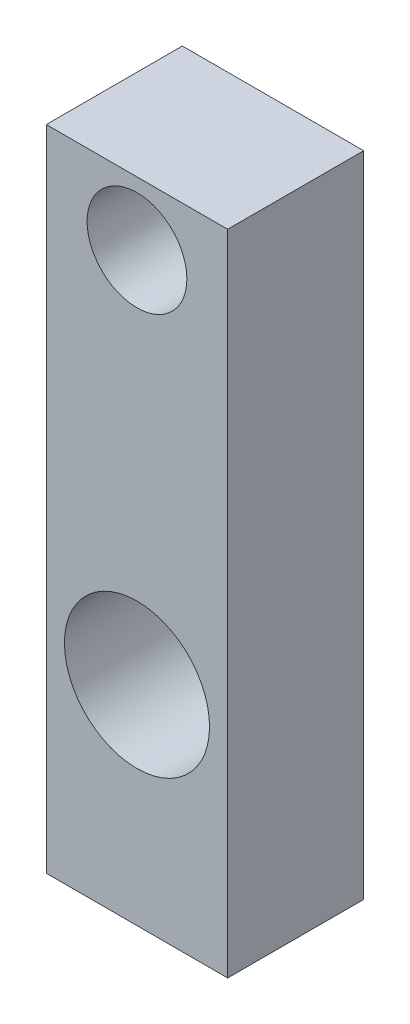
ISO-10303-21;
HEADER;
FILE_DESCRIPTION(('STEP AP214'),'2;1');
FILE_NAME('part.step','',(''),(''),'','','');
FILE_SCHEMA(('AUTOMOTIVE_DESIGN { 1 0 10303 214 1 1 1 1 }'));
ENDSEC;
DATA;
#1=APPLICATION_CONTEXT('core data for automotive mechanical design processes');
#2=APPLICATION_PROTOCOL_DEFINITION('international standard','automotive_design',2000,#1);
#3=PRODUCT_CONTEXT('',#1,'mechanical');
#4=PRODUCT('Part','Part','',(#3));
#5=PRODUCT_RELATED_PRODUCT_CATEGORY('part','',(#4));
#6=PRODUCT_DEFINITION_FORMATION('','',#4);
#7=PRODUCT_DEFINITION_CONTEXT('part definition',#1,'design');
#8=PRODUCT_DEFINITION('design','',#6,#7);
#9=PRODUCT_DEFINITION_SHAPE('','',#8);
#10=(LENGTH_UNIT() NAMED_UNIT(*) SI_UNIT(.MILLI.,.METRE.));
#11=(NAMED_UNIT(*) PLANE_ANGLE_UNIT() SI_UNIT($,.RADIAN.));
#12=(NAMED_UNIT(*) SI_UNIT($,.STERADIAN.) SOLID_ANGLE_UNIT());
#13=UNCERTAINTY_MEASURE_WITH_UNIT(LENGTH_MEASURE(1.E-05),#10,'distance_accuracy_value','');
#14=(GEOMETRIC_REPRESENTATION_CONTEXT(3) GLOBAL_UNCERTAINTY_ASSIGNED_CONTEXT((#13)) GLOBAL_UNIT_ASSIGNED_CONTEXT((#10,
#11,#12)) REPRESENTATION_CONTEXT('',''));
#15=CARTESIAN_POINT('',(0.,0.,0.));
#16=DIRECTION('',(0.,0.,1.));
#17=DIRECTION('',(1.,0.,0.));
#18=AXIS2_PLACEMENT_3D('',#15,#16,#17);
#19=CARTESIAN_POINT('',(0.,0.,30.));
#20=DIRECTION('',(0.,0.,-1.));
#21=DIRECTION('',(-1.,0.,0.));
#22=AXIS2_PLACEMENT_3D('',#19,#20,#21);
#23=PLANE('',#22);
#24=CARTESIAN_POINT('',(20.,46.,30.));
#25=DIRECTION('',(0.,0.,1.));
#26=DIRECTION('',(1.,0.,0.));
#27=AXIS2_PLACEMENT_3D('',#24,#25,#26);
#28=CIRCLE('',#27,16.);
#29=CARTESIAN_POINT('',(36.,46.,30.));
#30=VERTEX_POINT('',#29);
#31=EDGE_CURVE('E100',#30,#30,#28,.T.);
#32=ORIENTED_EDGE('',*,*,#31,.F.);
#33=EDGE_LOOP('',(#32));
#34=FACE_BOUND('',#33,.T.);
#35=DIRECTION('',(0.,-1.,0.));
#36=VECTOR('',#35,1.);
#37=CARTESIAN_POINT('',(0.,0.,30.));
#38=LINE('',#37,#36);
#39=CARTESIAN_POINT('',(0.,143.,30.));
#40=VERTEX_POINT('',#39);
#41=CARTESIAN_POINT('',(0.,0.,30.));
#42=VERTEX_POINT('',#41);
#43=EDGE_CURVE('E85',#40,#42,#38,.T.);
#44=ORIENTED_EDGE('',*,*,#43,.T.);
#45=DIRECTION('',(1.,0.,0.));
#46=VECTOR('',#45,1.);
#47=CARTESIAN_POINT('',(0.,0.,30.));
#48=LINE('',#47,#46);
#49=CARTESIAN_POINT('',(40.,0.,30.));
#50=VERTEX_POINT('',#49);
#51=EDGE_CURVE('E80',#42,#50,#48,.T.);
#52=ORIENTED_EDGE('',*,*,#51,.T.);
#53=DIRECTION('',(0.,1.,0.));
#54=VECTOR('',#53,1.);
#55=CARTESIAN_POINT('',(40.,0.,30.));
#56=LINE('',#55,#54);
#57=CARTESIAN_POINT('',(40.,143.,30.));
#58=VERTEX_POINT('',#57);
#59=EDGE_CURVE('E83',#50,#58,#56,.T.);
#60=ORIENTED_EDGE('',*,*,#59,.T.);
#61=DIRECTION('',(-1.,0.,0.));
#62=VECTOR('',#61,1.);
#63=CARTESIAN_POINT('',(0.,143.,30.));
#64=LINE('',#63,#62);
#65=EDGE_CURVE('E50',#58,#40,#64,.T.);
#66=ORIENTED_EDGE('',*,*,#65,.T.);
#67=EDGE_LOOP('',(#44,#52,#60,#66));
#68=FACE_BOUND('',#67,.T.);
#69=CARTESIAN_POINT('',(20.,129.,30.));
#70=DIRECTION('',(0.,0.,1.));
#71=DIRECTION('',(1.,0.,0.));
#72=AXIS2_PLACEMENT_3D('',#69,#70,#71);
#73=CIRCLE('',#72,11.);
#74=CARTESIAN_POINT('',(31.,129.,30.));
#75=VERTEX_POINT('',#74);
#76=EDGE_CURVE('E115',#75,#75,#73,.T.);
#77=ORIENTED_EDGE('',*,*,#76,.F.);
#78=EDGE_LOOP('',(#77));
#79=FACE_BOUND('',#78,.T.);
#80=ADVANCED_FACE('F33',(#34,#68,#79),#23,.F.);
#81=CARTESIAN_POINT('',(0.,0.,0.));
#82=DIRECTION('',(0.,0.,-1.));
#83=DIRECTION('',(-1.,0.,0.));
#84=AXIS2_PLACEMENT_3D('',#81,#82,#83);
#85=PLANE('',#84);
#86=CARTESIAN_POINT('',(20.,46.,0.));
#87=DIRECTION('',(0.,0.,1.));
#88=DIRECTION('',(1.,0.,0.));
#89=AXIS2_PLACEMENT_3D('',#86,#87,#88);
#90=CIRCLE('',#89,16.);
#91=CARTESIAN_POINT('',(36.,46.,0.));
#92=VERTEX_POINT('',#91);
#93=EDGE_CURVE('E112',#92,#92,#90,.T.);
#94=ORIENTED_EDGE('',*,*,#93,.T.);
#95=EDGE_LOOP('',(#94));
#96=FACE_BOUND('',#95,.T.);
#97=DIRECTION('',(0.,-1.,0.));
#98=VECTOR('',#97,1.);
#99=CARTESIAN_POINT('',(0.,0.,0.));
#100=LINE('',#99,#98);
#101=CARTESIAN_POINT('',(0.,143.,0.));
#102=VERTEX_POINT('',#101);
#103=CARTESIAN_POINT('',(0.,0.,0.));
#104=VERTEX_POINT('',#103);
#105=EDGE_CURVE('E97',#102,#104,#100,.T.);
#106=ORIENTED_EDGE('',*,*,#105,.F.);
#107=DIRECTION('',(-1.,0.,0.));
#108=VECTOR('',#107,1.);
#109=CARTESIAN_POINT('',(0.,143.,0.));
#110=LINE('',#109,#108);
#111=CARTESIAN_POINT('',(40.,143.,0.));
#112=VERTEX_POINT('',#111);
#113=EDGE_CURVE('E73',#112,#102,#110,.T.);
#114=ORIENTED_EDGE('',*,*,#113,.F.);
#115=DIRECTION('',(0.,1.,0.));
#116=VECTOR('',#115,1.);
#117=CARTESIAN_POINT('',(40.,0.,0.));
#118=LINE('',#117,#116);
#119=CARTESIAN_POINT('',(40.,0.,0.));
#120=VERTEX_POINT('',#119);
#121=EDGE_CURVE('E67',#120,#112,#118,.T.);
#122=ORIENTED_EDGE('',*,*,#121,.F.);
#123=DIRECTION('',(1.,0.,0.));
#124=VECTOR('',#123,1.);
#125=CARTESIAN_POINT('',(0.,0.,0.));
#126=LINE('',#125,#124);
#127=EDGE_CURVE('E89',#104,#120,#126,.T.);
#128=ORIENTED_EDGE('',*,*,#127,.F.);
#129=EDGE_LOOP('',(#106,#114,#122,#128));
#130=FACE_BOUND('',#129,.T.);
#131=CARTESIAN_POINT('',(20.,129.,0.));
#132=DIRECTION('',(0.,0.,1.));
#133=DIRECTION('',(1.,0.,0.));
#134=AXIS2_PLACEMENT_3D('',#131,#132,#133);
#135=CIRCLE('',#134,11.);
#136=CARTESIAN_POINT('',(31.,129.,0.));
#137=VERTEX_POINT('',#136);
#138=EDGE_CURVE('E118',#137,#137,#135,.T.);
#139=ORIENTED_EDGE('',*,*,#138,.T.);
#140=EDGE_LOOP('',(#139));
#141=FACE_BOUND('',#140,.T.);
#142=ADVANCED_FACE('F108',(#96,#130,#141),#85,.T.);
#143=CARTESIAN_POINT('',(0.,0.,30.));
#144=DIRECTION('',(1.,0.,0.));
#145=DIRECTION('',(0.,0.,-1.));
#146=AXIS2_PLACEMENT_3D('',#143,#144,#145);
#147=PLANE('',#146);
#148=ORIENTED_EDGE('',*,*,#105,.T.);
#149=DIRECTION('',(0.,0.,-1.));
#150=VECTOR('',#149,1.);
#151=CARTESIAN_POINT('',(0.,0.,30.));
#152=LINE('',#151,#150);
#153=EDGE_CURVE('E11',#42,#104,#152,.T.);
#154=ORIENTED_EDGE('',*,*,#153,.F.);
#155=ORIENTED_EDGE('',*,*,#43,.F.);
#156=DIRECTION('',(0.,0.,-1.));
#157=VECTOR('',#156,1.);
#158=CARTESIAN_POINT('',(0.,143.,30.));
#159=LINE('',#158,#157);
#160=EDGE_CURVE('E93',#40,#102,#159,.T.);
#161=ORIENTED_EDGE('',*,*,#160,.T.);
#162=EDGE_LOOP('',(#148,#154,#155,#161));
#163=FACE_BOUND('',#162,.T.);
#164=ADVANCED_FACE('F35',(#163),#147,.F.);
#165=CARTESIAN_POINT('',(0.,0.,30.));
#166=DIRECTION('',(0.,1.,0.));
#167=DIRECTION('',(0.,0.,1.));
#168=AXIS2_PLACEMENT_3D('',#165,#166,#167);
#169=PLANE('',#168);
#170=ORIENTED_EDGE('',*,*,#127,.T.);
#171=DIRECTION('',(0.,0.,-1.));
#172=VECTOR('',#171,1.);
#173=CARTESIAN_POINT('',(40.,0.,30.));
#174=LINE('',#173,#172);
#175=EDGE_CURVE('E42',#50,#120,#174,.T.);
#176=ORIENTED_EDGE('',*,*,#175,.F.);
#177=ORIENTED_EDGE('',*,*,#51,.F.);
#178=ORIENTED_EDGE('',*,*,#153,.T.);
#179=EDGE_LOOP('',(#170,#176,#177,#178));
#180=FACE_BOUND('',#179,.T.);
#181=ADVANCED_FACE('F88',(#180),#169,.F.);
#182=CARTESIAN_POINT('',(40.,0.,30.));
#183=DIRECTION('',(-1.,0.,0.));
#184=DIRECTION('',(0.,0.,1.));
#185=AXIS2_PLACEMENT_3D('',#182,#183,#184);
#186=PLANE('',#185);
#187=ORIENTED_EDGE('',*,*,#121,.T.);
#188=DIRECTION('',(0.,0.,-1.));
#189=VECTOR('',#188,1.);
#190=CARTESIAN_POINT('',(40.,143.,30.));
#191=LINE('',#190,#189);
#192=EDGE_CURVE('E90',#58,#112,#191,.T.);
#193=ORIENTED_EDGE('',*,*,#192,.F.);
#194=ORIENTED_EDGE('',*,*,#59,.F.);
#195=ORIENTED_EDGE('',*,*,#175,.T.);
#196=EDGE_LOOP('',(#187,#193,#194,#195));
#197=FACE_BOUND('',#196,.T.);
#198=ADVANCED_FACE('F91',(#197),#186,.F.);
#199=CARTESIAN_POINT('',(0.,143.,30.));
#200=DIRECTION('',(0.,-1.,0.));
#201=DIRECTION('',(0.,0.,-1.));
#202=AXIS2_PLACEMENT_3D('',#199,#200,#201);
#203=PLANE('',#202);
#204=ORIENTED_EDGE('',*,*,#113,.T.);
#205=ORIENTED_EDGE('',*,*,#160,.F.);
#206=ORIENTED_EDGE('',*,*,#65,.F.);
#207=ORIENTED_EDGE('',*,*,#192,.T.);
#208=EDGE_LOOP('',(#204,#205,#206,#207));
#209=FACE_BOUND('',#208,.T.);
#210=ADVANCED_FACE('F105',(#209),#203,.F.);
#211=CARTESIAN_POINT('',(20.,46.,30.));
#212=DIRECTION('',(0.,0.,-1.));
#213=DIRECTION('',(-1.,0.,0.));
#214=AXIS2_PLACEMENT_3D('',#211,#212,#213);
#215=CYLINDRICAL_SURFACE('',#214,16.);
#216=ORIENTED_EDGE('',*,*,#31,.T.);
#217=EDGE_LOOP('',(#216));
#218=FACE_BOUND('',#217,.T.);
#219=ORIENTED_EDGE('',*,*,#93,.F.);
#220=EDGE_LOOP('',(#219));
#221=FACE_BOUND('',#220,.T.);
#222=ADVANCED_FACE('F136',(#218,#221),#215,.F.);
#223=CARTESIAN_POINT('',(20.,129.,30.));
#224=DIRECTION('',(0.,0.,-1.));
#225=DIRECTION('',(-1.,0.,0.));
#226=AXIS2_PLACEMENT_3D('',#223,#224,#225);
#227=CYLINDRICAL_SURFACE('',#226,11.);
#228=ORIENTED_EDGE('',*,*,#76,.T.);
#229=EDGE_LOOP('',(#228));
#230=FACE_BOUND('',#229,.T.);
#231=ORIENTED_EDGE('',*,*,#138,.F.);
#232=EDGE_LOOP('',(#231));
#233=FACE_BOUND('',#232,.T.);
#234=ADVANCED_FACE('F124',(#230,#233),#227,.F.);
#235=CLOSED_SHELL('',(#80,#142,#164,#181,#198,#210,#222,#234));
#236=MANIFOLD_SOLID_BREP('B2',#235);
#237=ADVANCED_BREP_SHAPE_REPRESENTATION('',(#18,#236),#14);
#238=SHAPE_DEFINITION_REPRESENTATION(#9,#237);
ENDSEC;
END-ISO-10303-21;
